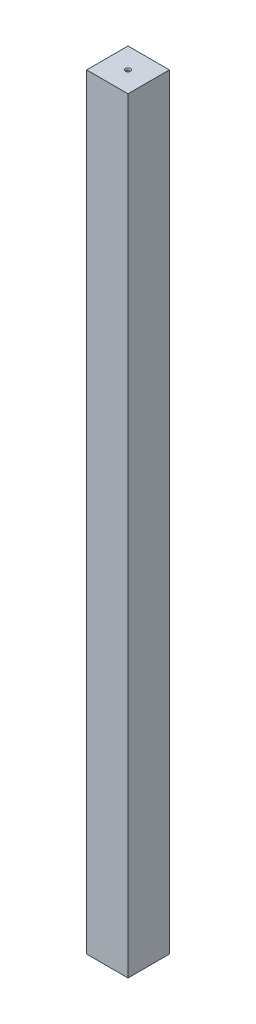
ISO-10303-21;
HEADER;
FILE_DESCRIPTION(('STEP AP214'),'2;1');
FILE_NAME('part.step','',(''),(''),'','','');
FILE_SCHEMA(('AUTOMOTIVE_DESIGN { 1 0 10303 214 1 1 1 1 }'));
ENDSEC;
DATA;
#1=APPLICATION_CONTEXT('core data for automotive mechanical design processes');
#2=APPLICATION_PROTOCOL_DEFINITION('international standard','automotive_design',2000,#1);
#3=PRODUCT_CONTEXT('',#1,'mechanical');
#4=PRODUCT('Part','Part','',(#3));
#5=PRODUCT_RELATED_PRODUCT_CATEGORY('part','',(#4));
#6=PRODUCT_DEFINITION_FORMATION('','',#4);
#7=PRODUCT_DEFINITION_CONTEXT('part definition',#1,'design');
#8=PRODUCT_DEFINITION('design','',#6,#7);
#9=PRODUCT_DEFINITION_SHAPE('','',#8);
#10=(LENGTH_UNIT() NAMED_UNIT(*) SI_UNIT(.MILLI.,.METRE.));
#11=(NAMED_UNIT(*) PLANE_ANGLE_UNIT() SI_UNIT($,.RADIAN.));
#12=(NAMED_UNIT(*) SI_UNIT($,.STERADIAN.) SOLID_ANGLE_UNIT());
#13=UNCERTAINTY_MEASURE_WITH_UNIT(LENGTH_MEASURE(1.E-05),#10,'distance_accuracy_value','');
#14=(GEOMETRIC_REPRESENTATION_CONTEXT(3) GLOBAL_UNCERTAINTY_ASSIGNED_CONTEXT((#13)) GLOBAL_UNIT_ASSIGNED_CONTEXT((#10,
#11,#12)) REPRESENTATION_CONTEXT('',''));
#15=CARTESIAN_POINT('',(0.,0.,0.));
#16=DIRECTION('',(0.,0.,1.));
#17=DIRECTION('',(1.,0.,0.));
#18=AXIS2_PLACEMENT_3D('',#15,#16,#17);
#19=CARTESIAN_POINT('',(12.7,235.,-12.7));
#20=DIRECTION('',(-1.,0.,0.));
#21=DIRECTION('',(0.,0.,1.));
#22=AXIS2_PLACEMENT_3D('',#19,#20,#21);
#23=PLANE('',#22);
#24=DIRECTION('',(0.,0.,-1.));
#25=VECTOR('',#24,1.);
#26=CARTESIAN_POINT('',(12.7,-235.,-12.7));
#27=LINE('',#26,#25);
#28=CARTESIAN_POINT('',(12.7,-235.,12.7));
#29=VERTEX_POINT('',#28);
#30=CARTESIAN_POINT('',(12.7,-235.,-12.7));
#31=VERTEX_POINT('',#30);
#32=EDGE_CURVE('E128',#29,#31,#27,.T.);
#33=ORIENTED_EDGE('',*,*,#32,.T.);
#34=DIRECTION('',(0.,-1.,0.));
#35=VECTOR('',#34,1.);
#36=CARTESIAN_POINT('',(12.7,235.,-12.7));
#37=LINE('',#36,#35);
#38=CARTESIAN_POINT('',(12.7,235.,-12.7));
#39=VERTEX_POINT('',#38);
#40=EDGE_CURVE('E13',#39,#31,#37,.T.);
#41=ORIENTED_EDGE('',*,*,#40,.F.);
#42=DIRECTION('',(0.,0.,-1.));
#43=VECTOR('',#42,1.);
#44=CARTESIAN_POINT('',(12.7,235.,-12.7));
#45=LINE('',#44,#43);
#46=CARTESIAN_POINT('',(12.7,235.,12.7));
#47=VERTEX_POINT('',#46);
#48=EDGE_CURVE('E129',#47,#39,#45,.T.);
#49=ORIENTED_EDGE('',*,*,#48,.F.);
#50=DIRECTION('',(0.,-1.,0.));
#51=VECTOR('',#50,1.);
#52=CARTESIAN_POINT('',(12.7,235.,12.7));
#53=LINE('',#52,#51);
#54=EDGE_CURVE('E135',#47,#29,#53,.T.);
#55=ORIENTED_EDGE('',*,*,#54,.T.);
#56=EDGE_LOOP('',(#33,#41,#49,#55));
#57=FACE_BOUND('',#56,.T.);
#58=ADVANCED_FACE('F48',(#57),#23,.F.);
#59=CARTESIAN_POINT('',(-12.7,235.,-12.7));
#60=DIRECTION('',(0.,0.,1.));
#61=DIRECTION('',(1.,0.,0.));
#62=AXIS2_PLACEMENT_3D('',#59,#60,#61);
#63=PLANE('',#62);
#64=DIRECTION('',(-1.,0.,0.));
#65=VECTOR('',#64,1.);
#66=CARTESIAN_POINT('',(-12.7,-235.,-12.7));
#67=LINE('',#66,#65);
#68=CARTESIAN_POINT('',(-12.7,-235.,-12.7));
#69=VERTEX_POINT('',#68);
#70=EDGE_CURVE('E138',#31,#69,#67,.T.);
#71=ORIENTED_EDGE('',*,*,#70,.T.);
#72=DIRECTION('',(0.,-1.,0.));
#73=VECTOR('',#72,1.);
#74=CARTESIAN_POINT('',(-12.7,235.,-12.7));
#75=LINE('',#74,#73);
#76=CARTESIAN_POINT('',(-12.7,235.,-12.7));
#77=VERTEX_POINT('',#76);
#78=EDGE_CURVE('E56',#77,#69,#75,.T.);
#79=ORIENTED_EDGE('',*,*,#78,.F.);
#80=DIRECTION('',(-1.,0.,0.));
#81=VECTOR('',#80,1.);
#82=CARTESIAN_POINT('',(-12.7,235.,-12.7));
#83=LINE('',#82,#81);
#84=EDGE_CURVE('E95',#39,#77,#83,.T.);
#85=ORIENTED_EDGE('',*,*,#84,.F.);
#86=ORIENTED_EDGE('',*,*,#40,.T.);
#87=EDGE_LOOP('',(#71,#79,#85,#86));
#88=FACE_BOUND('',#87,.T.);
#89=ADVANCED_FACE('F162',(#88),#63,.F.);
#90=CARTESIAN_POINT('',(-12.7,235.,-12.7));
#91=DIRECTION('',(1.,0.,0.));
#92=DIRECTION('',(0.,0.,-1.));
#93=AXIS2_PLACEMENT_3D('',#90,#91,#92);
#94=PLANE('',#93);
#95=DIRECTION('',(0.,0.,1.));
#96=VECTOR('',#95,1.);
#97=CARTESIAN_POINT('',(-12.7,-235.,-12.7));
#98=LINE('',#97,#96);
#99=CARTESIAN_POINT('',(-12.7,-235.,12.7));
#100=VERTEX_POINT('',#99);
#101=EDGE_CURVE('E82',#69,#100,#98,.T.);
#102=ORIENTED_EDGE('',*,*,#101,.T.);
#103=DIRECTION('',(0.,-1.,0.));
#104=VECTOR('',#103,1.);
#105=CARTESIAN_POINT('',(-12.7,235.,12.7));
#106=LINE('',#105,#104);
#107=CARTESIAN_POINT('',(-12.7,235.,12.7));
#108=VERTEX_POINT('',#107);
#109=EDGE_CURVE('E143',#108,#100,#106,.T.);
#110=ORIENTED_EDGE('',*,*,#109,.F.);
#111=DIRECTION('',(0.,0.,1.));
#112=VECTOR('',#111,1.);
#113=CARTESIAN_POINT('',(-12.7,235.,-12.7));
#114=LINE('',#113,#112);
#115=EDGE_CURVE('E132',#77,#108,#114,.T.);
#116=ORIENTED_EDGE('',*,*,#115,.F.);
#117=ORIENTED_EDGE('',*,*,#78,.T.);
#118=EDGE_LOOP('',(#102,#110,#116,#117));
#119=FACE_BOUND('',#118,.T.);
#120=ADVANCED_FACE('F145',(#119),#94,.F.);
#121=CARTESIAN_POINT('',(-12.7,235.,12.7));
#122=DIRECTION('',(0.,0.,-1.));
#123=DIRECTION('',(-1.,0.,0.));
#124=AXIS2_PLACEMENT_3D('',#121,#122,#123);
#125=PLANE('',#124);
#126=DIRECTION('',(1.,0.,0.));
#127=VECTOR('',#126,1.);
#128=CARTESIAN_POINT('',(-12.7,-235.,12.7));
#129=LINE('',#128,#127);
#130=EDGE_CURVE('E88',#100,#29,#129,.T.);
#131=ORIENTED_EDGE('',*,*,#130,.T.);
#132=ORIENTED_EDGE('',*,*,#54,.F.);
#133=DIRECTION('',(1.,0.,0.));
#134=VECTOR('',#133,1.);
#135=CARTESIAN_POINT('',(-12.7,235.,12.7));
#136=LINE('',#135,#134);
#137=EDGE_CURVE('E64',#108,#47,#136,.T.);
#138=ORIENTED_EDGE('',*,*,#137,.F.);
#139=ORIENTED_EDGE('',*,*,#109,.T.);
#140=EDGE_LOOP('',(#131,#132,#138,#139));
#141=FACE_BOUND('',#140,.T.);
#142=ADVANCED_FACE('F152',(#141),#125,.F.);
#143=CARTESIAN_POINT('',(0.,235.,0.));
#144=DIRECTION('',(0.,1.,0.));
#145=DIRECTION('',(0.,0.,1.));
#146=AXIS2_PLACEMENT_3D('',#143,#144,#145);
#147=PLANE('',#146);
#148=CARTESIAN_POINT('',(0.,235.,0.));
#149=DIRECTION('',(0.,1.,0.));
#150=DIRECTION('',(0.,0.,1.));
#151=AXIS2_PLACEMENT_3D('',#148,#149,#150);
#152=CIRCLE('',#151,1.5113);
#153=CARTESIAN_POINT('',(0.,235.,1.5113));
#154=VERTEX_POINT('',#153);
#155=EDGE_CURVE('E112',#154,#154,#152,.T.);
#156=ORIENTED_EDGE('',*,*,#155,.F.);
#157=EDGE_LOOP('',(#156));
#158=FACE_BOUND('',#157,.T.);
#159=ORIENTED_EDGE('',*,*,#48,.T.);
#160=ORIENTED_EDGE('',*,*,#84,.T.);
#161=ORIENTED_EDGE('',*,*,#115,.T.);
#162=ORIENTED_EDGE('',*,*,#137,.T.);
#163=EDGE_LOOP('',(#159,#160,#161,#162));
#164=FACE_BOUND('',#163,.T.);
#165=ADVANCED_FACE('F154',(#158,#164),#147,.T.);
#166=CARTESIAN_POINT('',(0.,-235.,0.));
#167=DIRECTION('',(0.,1.,0.));
#168=DIRECTION('',(0.,0.,1.));
#169=AXIS2_PLACEMENT_3D('',#166,#167,#168);
#170=PLANE('',#169);
#171=CARTESIAN_POINT('',(0.,-235.,0.));
#172=DIRECTION('',(0.,-1.,0.));
#173=DIRECTION('',(0.,0.,-1.));
#174=AXIS2_PLACEMENT_3D('',#171,#172,#173);
#175=CIRCLE('',#174,1.5113);
#176=CARTESIAN_POINT('',(0.,-235.,-1.5113));
#177=VERTEX_POINT('',#176);
#178=EDGE_CURVE('E119',#177,#177,#175,.T.);
#179=ORIENTED_EDGE('',*,*,#178,.F.);
#180=EDGE_LOOP('',(#179));
#181=FACE_BOUND('',#180,.T.);
#182=ORIENTED_EDGE('',*,*,#32,.F.);
#183=ORIENTED_EDGE('',*,*,#130,.F.);
#184=ORIENTED_EDGE('',*,*,#101,.F.);
#185=ORIENTED_EDGE('',*,*,#70,.F.);
#186=EDGE_LOOP('',(#182,#183,#184,#185));
#187=FACE_BOUND('',#186,.T.);
#188=ADVANCED_FACE('F148',(#181,#187),#170,.F.);
#189=CARTESIAN_POINT('',(0.,203.25,0.));
#190=DIRECTION('',(0.,1.,0.));
#191=DIRECTION('',(0.,0.,1.));
#192=AXIS2_PLACEMENT_3D('',#189,#190,#191);
#193=CONICAL_SURFACE('',#192,0.806449999999992,1.02974425867665);
#194=CARTESIAN_POINT('',(0.,202.765435953785,0.));
#195=VERTEX_POINT('',#194);
#196=VERTEX_LOOP('',#195);
#197=FACE_BOUND('',#196,.T.);
#198=CARTESIAN_POINT('',(0.,203.25,0.));
#199=DIRECTION('',(0.,1.,0.));
#200=DIRECTION('',(0.,0.,1.));
#201=AXIS2_PLACEMENT_3D('',#198,#199,#200);
#202=CIRCLE('',#201,0.806449999999992);
#203=CARTESIAN_POINT('',(0.,203.25,0.806449999999992));
#204=VERTEX_POINT('',#203);
#205=EDGE_CURVE('E125',#204,#204,#202,.T.);
#206=ORIENTED_EDGE('',*,*,#205,.T.);
#207=EDGE_LOOP('',(#206));
#208=FACE_BOUND('',#207,.T.);
#209=ADVANCED_FACE('F192',(#197,#208),#193,.F.);
#210=CARTESIAN_POINT('',(0.,235.,0.));
#211=DIRECTION('',(0.,1.,0.));
#212=DIRECTION('',(0.,0.,1.));
#213=AXIS2_PLACEMENT_3D('',#210,#211,#212);
#214=CYLINDRICAL_SURFACE('',#213,0.806449999999994);
#215=ORIENTED_EDGE('',*,*,#205,.F.);
#216=EDGE_LOOP('',(#215));
#217=FACE_BOUND('',#216,.T.);
#218=CARTESIAN_POINT('',(0.,234.408560624965,0.));
#219=DIRECTION('',(0.,1.,0.));
#220=DIRECTION('',(0.,0.,1.));
#221=AXIS2_PLACEMENT_3D('',#218,#219,#220);
#222=CIRCLE('',#221,0.806449999999996);
#223=CARTESIAN_POINT('',(0.,234.408560624965,0.806449999999996));
#224=VERTEX_POINT('',#223);
#225=EDGE_CURVE('E116',#224,#224,#222,.T.);
#226=ORIENTED_EDGE('',*,*,#225,.T.);
#227=EDGE_LOOP('',(#226));
#228=FACE_BOUND('',#227,.T.);
#229=ADVANCED_FACE('F197',(#217,#228),#214,.F.);
#230=CARTESIAN_POINT('',(0.,235.,0.));
#231=DIRECTION('',(0.,1.,0.));
#232=DIRECTION('',(0.,0.,1.));
#233=AXIS2_PLACEMENT_3D('',#230,#231,#232);
#234=CONICAL_SURFACE('',#233,1.5113,0.872664625997166);
#235=ORIENTED_EDGE('',*,*,#225,.F.);
#236=EDGE_LOOP('',(#235));
#237=FACE_BOUND('',#236,.T.);
#238=ORIENTED_EDGE('',*,*,#155,.T.);
#239=EDGE_LOOP('',(#238));
#240=FACE_BOUND('',#239,.T.);
#241=ADVANCED_FACE('F106',(#237,#240),#234,.F.);
#242=CARTESIAN_POINT('',(0.,-203.25,0.));
#243=DIRECTION('',(0.,-1.,0.));
#244=DIRECTION('',(0.,0.,-1.));
#245=AXIS2_PLACEMENT_3D('',#242,#243,#244);
#246=CONICAL_SURFACE('',#245,0.806449999999992,1.02974425867665);
#247=CARTESIAN_POINT('',(0.,-202.765435953785,0.));
#248=VERTEX_POINT('',#247);
#249=VERTEX_LOOP('',#248);
#250=FACE_BOUND('',#249,.T.);
#251=CARTESIAN_POINT('',(0.,-203.25,0.));
#252=DIRECTION('',(0.,-1.,0.));
#253=DIRECTION('',(0.,0.,-1.));
#254=AXIS2_PLACEMENT_3D('',#251,#252,#253);
#255=CIRCLE('',#254,0.806449999999992);
#256=CARTESIAN_POINT('',(0.,-203.25,-0.806449999999992));
#257=VERTEX_POINT('',#256);
#258=EDGE_CURVE('E110',#257,#257,#255,.T.);
#259=ORIENTED_EDGE('',*,*,#258,.T.);
#260=EDGE_LOOP('',(#259));
#261=FACE_BOUND('',#260,.T.);
#262=ADVANCED_FACE('F102',(#250,#261),#246,.F.);
#263=CARTESIAN_POINT('',(0.,-235.,0.));
#264=DIRECTION('',(0.,-1.,0.));
#265=DIRECTION('',(0.,0.,-1.));
#266=AXIS2_PLACEMENT_3D('',#263,#264,#265);
#267=CYLINDRICAL_SURFACE('',#266,0.806449999999994);
#268=ORIENTED_EDGE('',*,*,#258,.F.);
#269=EDGE_LOOP('',(#268));
#270=FACE_BOUND('',#269,.T.);
#271=CARTESIAN_POINT('',(0.,-234.408560624965,0.));
#272=DIRECTION('',(0.,-1.,0.));
#273=DIRECTION('',(0.,0.,-1.));
#274=AXIS2_PLACEMENT_3D('',#271,#272,#273);
#275=CIRCLE('',#274,0.806449999999996);
#276=CARTESIAN_POINT('',(0.,-234.408560624965,-0.806449999999996));
#277=VERTEX_POINT('',#276);
#278=EDGE_CURVE('E113',#277,#277,#275,.T.);
#279=ORIENTED_EDGE('',*,*,#278,.T.);
#280=EDGE_LOOP('',(#279));
#281=FACE_BOUND('',#280,.T.);
#282=ADVANCED_FACE('F105',(#270,#281),#267,.F.);
#283=CARTESIAN_POINT('',(0.,-235.,0.));
#284=DIRECTION('',(0.,-1.,0.));
#285=DIRECTION('',(0.,0.,-1.));
#286=AXIS2_PLACEMENT_3D('',#283,#284,#285);
#287=CONICAL_SURFACE('',#286,1.5113,0.872664625997166);
#288=ORIENTED_EDGE('',*,*,#278,.F.);
#289=EDGE_LOOP('',(#288));
#290=FACE_BOUND('',#289,.T.);
#291=ORIENTED_EDGE('',*,*,#178,.T.);
#292=EDGE_LOOP('',(#291));
#293=FACE_BOUND('',#292,.T.);
#294=ADVANCED_FACE('F240',(#290,#293),#287,.F.);
#295=CLOSED_SHELL('',(#58,#89,#120,#142,#165,#188,#209,#229,#241,#262,#282,#294));
#296=MANIFOLD_SOLID_BREP('B2',#295);
#297=ADVANCED_BREP_SHAPE_REPRESENTATION('',(#18,#296),#14);
#298=SHAPE_DEFINITION_REPRESENTATION(#9,#297);
ENDSEC;
END-ISO-10303-21;
